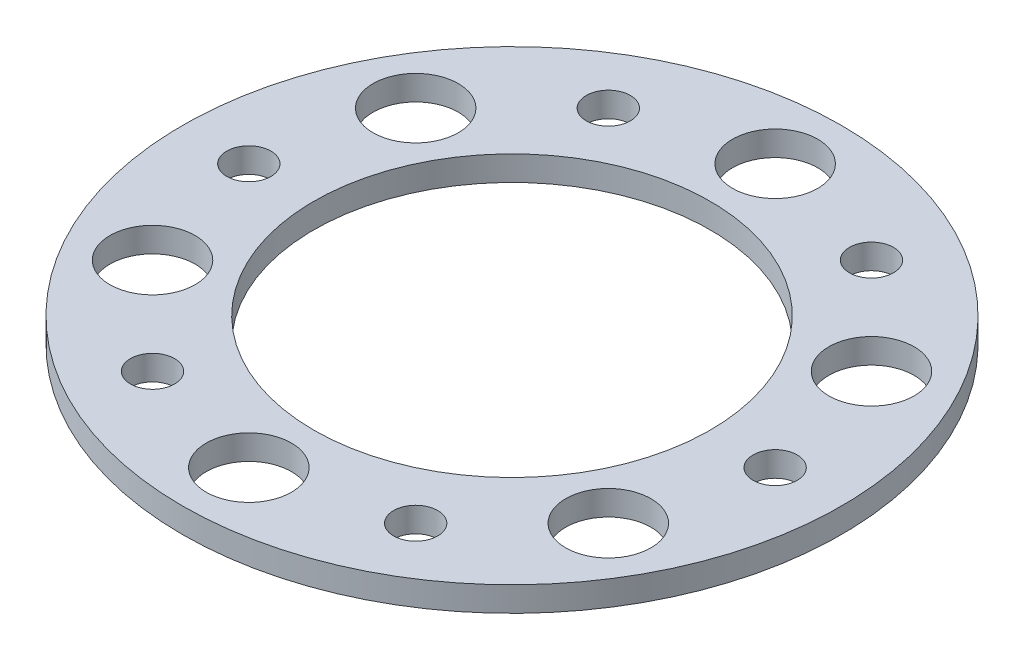
ISO-10303-21;
HEADER;
FILE_DESCRIPTION(('STEP AP214'),'2;1');
FILE_NAME('part.step','',(''),(''),'','','');
FILE_SCHEMA(('AUTOMOTIVE_DESIGN { 1 0 10303 214 1 1 1 1 }'));
ENDSEC;
DATA;
#1=APPLICATION_CONTEXT('core data for automotive mechanical design processes');
#2=APPLICATION_PROTOCOL_DEFINITION('international standard','automotive_design',2000,#1);
#3=PRODUCT_CONTEXT('',#1,'mechanical');
#4=PRODUCT('Part','Part','',(#3));
#5=PRODUCT_RELATED_PRODUCT_CATEGORY('part','',(#4));
#6=PRODUCT_DEFINITION_FORMATION('','',#4);
#7=PRODUCT_DEFINITION_CONTEXT('part definition',#1,'design');
#8=PRODUCT_DEFINITION('design','',#6,#7);
#9=PRODUCT_DEFINITION_SHAPE('','',#8);
#10=(LENGTH_UNIT() NAMED_UNIT(*) SI_UNIT(.MILLI.,.METRE.));
#11=(NAMED_UNIT(*) PLANE_ANGLE_UNIT() SI_UNIT($,.RADIAN.));
#12=(NAMED_UNIT(*) SI_UNIT($,.STERADIAN.) SOLID_ANGLE_UNIT());
#13=UNCERTAINTY_MEASURE_WITH_UNIT(LENGTH_MEASURE(1.E-05),#10,'distance_accuracy_value','');
#14=(GEOMETRIC_REPRESENTATION_CONTEXT(3) GLOBAL_UNCERTAINTY_ASSIGNED_CONTEXT((#13)) GLOBAL_UNIT_ASSIGNED_CONTEXT((#10,
#11,#12)) REPRESENTATION_CONTEXT('',''));
#15=CARTESIAN_POINT('',(0.,0.,0.));
#16=DIRECTION('',(0.,0.,1.));
#17=DIRECTION('',(1.,0.,0.));
#18=AXIS2_PLACEMENT_3D('',#15,#16,#17);
#19=CARTESIAN_POINT('',(0.,1.27,0.));
#20=DIRECTION('',(0.,1.,0.));
#21=DIRECTION('',(0.,0.,1.));
#22=AXIS2_PLACEMENT_3D('',#19,#20,#21);
#23=PLANE('',#22);
#24=CARTESIAN_POINT('',(-6.74370000000002,1.27,-11.6804310310022));
#25=DIRECTION('',(0.,1.,0.));
#26=DIRECTION('',(0.,0.,1.));
#27=AXIS2_PLACEMENT_3D('',#24,#25,#26);
#28=CIRCLE('',#27,1.1303);
#29=CARTESIAN_POINT('',(-6.74370000000002,1.27,-10.5501310310022));
#30=VERTEX_POINT('',#29);
#31=EDGE_CURVE('E119',#30,#30,#28,.T.);
#32=ORIENTED_EDGE('',*,*,#31,.F.);
#33=EDGE_LOOP('',(#32));
#34=FACE_BOUND('',#33,.T.);
#35=CARTESIAN_POINT('',(6.74369999999998,1.27,-11.6804310310028));
#36=DIRECTION('',(0.,1.,0.));
#37=DIRECTION('',(0.,0.,1.));
#38=AXIS2_PLACEMENT_3D('',#35,#36,#37);
#39=CIRCLE('',#38,1.1303);
#40=CARTESIAN_POINT('',(6.74369999999998,1.27,-10.5501310310028));
#41=VERTEX_POINT('',#40);
#42=EDGE_CURVE('E113',#41,#41,#39,.T.);
#43=ORIENTED_EDGE('',*,*,#42,.F.);
#44=EDGE_LOOP('',(#43));
#45=FACE_BOUND('',#44,.T.);
#46=CARTESIAN_POINT('',(13.4874000000005,1.27,-8.26001260817148E-13));
#47=DIRECTION('',(0.,1.,0.));
#48=DIRECTION('',(0.,0.,1.));
#49=AXIS2_PLACEMENT_3D('',#46,#47,#48);
#50=CIRCLE('',#49,1.1303);
#51=CARTESIAN_POINT('',(13.4874000000005,1.27,1.13029999999917));
#52=VERTEX_POINT('',#51);
#53=EDGE_CURVE('E107',#52,#52,#50,.T.);
#54=ORIENTED_EDGE('',*,*,#53,.F.);
#55=EDGE_LOOP('',(#54));
#56=FACE_BOUND('',#55,.T.);
#57=CARTESIAN_POINT('',(6.74370000000095,1.27,11.6804310310017));
#58=DIRECTION('',(0.,1.,0.));
#59=DIRECTION('',(0.,0.,1.));
#60=AXIS2_PLACEMENT_3D('',#57,#58,#59);
#61=CIRCLE('',#60,1.1303);
#62=CARTESIAN_POINT('',(6.74370000000095,1.27,12.8107310310017));
#63=VERTEX_POINT('',#62);
#64=EDGE_CURVE('E101',#63,#63,#61,.T.);
#65=ORIENTED_EDGE('',*,*,#64,.F.);
#66=EDGE_LOOP('',(#65));
#67=FACE_BOUND('',#66,.T.);
#68=CARTESIAN_POINT('',(-6.74369999999905,1.27,11.6804310310023));
#69=DIRECTION('',(0.,1.,0.));
#70=DIRECTION('',(0.,0.,1.));
#71=AXIS2_PLACEMENT_3D('',#68,#69,#70);
#72=CIRCLE('',#71,1.1303);
#73=CARTESIAN_POINT('',(-6.74369999999905,1.27,12.8107310310023));
#74=VERTEX_POINT('',#73);
#75=EDGE_CURVE('E95',#74,#74,#72,.T.);
#76=ORIENTED_EDGE('',*,*,#75,.F.);
#77=EDGE_LOOP('',(#76));
#78=FACE_BOUND('',#77,.T.);
#79=CARTESIAN_POINT('',(-13.4873999999995,1.27,2.87911722612592E-13));
#80=DIRECTION('',(0.,1.,0.));
#81=DIRECTION('',(0.,0.,1.));
#82=AXIS2_PLACEMENT_3D('',#79,#80,#81);
#83=CIRCLE('',#82,1.1303);
#84=CARTESIAN_POINT('',(-13.4873999999995,1.27,1.13030000000029));
#85=VERTEX_POINT('',#84);
#86=EDGE_CURVE('E89',#85,#85,#83,.T.);
#87=ORIENTED_EDGE('',*,*,#86,.F.);
#88=EDGE_LOOP('',(#87));
#89=FACE_BOUND('',#88,.T.);
#90=CARTESIAN_POINT('',(11.6804310310025,1.27,-6.74370000000049));
#91=DIRECTION('',(0.,1.,0.));
#92=DIRECTION('',(0.,0.,1.));
#93=AXIS2_PLACEMENT_3D('',#90,#91,#92);
#94=CIRCLE('',#93,2.18439999999997);
#95=CARTESIAN_POINT('',(11.6804310310025,1.27,-4.55930000000052));
#96=VERTEX_POINT('',#95);
#97=EDGE_CURVE('E81',#96,#96,#94,.T.);
#98=ORIENTED_EDGE('',*,*,#97,.F.);
#99=EDGE_LOOP('',(#98));
#100=FACE_BOUND('',#99,.T.);
#101=CARTESIAN_POINT('',(11.6804310310031,1.27,6.74369999999951));
#102=DIRECTION('',(0.,1.,0.));
#103=DIRECTION('',(0.,0.,1.));
#104=AXIS2_PLACEMENT_3D('',#101,#102,#103);
#105=CIRCLE('',#104,2.18440000000055);
#106=CARTESIAN_POINT('',(11.6804310310031,1.27,8.92810000000006));
#107=VERTEX_POINT('',#106);
#108=EDGE_CURVE('E75',#107,#107,#105,.T.);
#109=ORIENTED_EDGE('',*,*,#108,.F.);
#110=EDGE_LOOP('',(#109));
#111=FACE_BOUND('',#110,.T.);
#112=CARTESIAN_POINT('',(1.14339797081937E-12,1.27,13.4874));
#113=DIRECTION('',(0.,1.,0.));
#114=DIRECTION('',(0.,0.,1.));
#115=AXIS2_PLACEMENT_3D('',#112,#113,#114);
#116=CIRCLE('',#115,2.184400000001);
#117=CARTESIAN_POINT('',(1.14339797081937E-12,1.27,15.671800000001));
#118=VERTEX_POINT('',#117);
#119=EDGE_CURVE('E69',#118,#118,#116,.T.);
#120=ORIENTED_EDGE('',*,*,#119,.F.);
#121=EDGE_LOOP('',(#120));
#122=FACE_BOUND('',#121,.T.);
#123=CARTESIAN_POINT('',(-11.6804310310014,1.27,6.74370000000049));
#124=DIRECTION('',(0.,1.,0.));
#125=DIRECTION('',(0.,0.,1.));
#126=AXIS2_PLACEMENT_3D('',#123,#124,#125);
#127=CIRCLE('',#126,2.1844000000009);
#128=CARTESIAN_POINT('',(-11.6804310310014,1.27,8.9281000000014));
#129=VERTEX_POINT('',#128);
#130=EDGE_CURVE('E63',#129,#129,#127,.T.);
#131=ORIENTED_EDGE('',*,*,#130,.F.);
#132=EDGE_LOOP('',(#131));
#133=FACE_BOUND('',#132,.T.);
#134=CARTESIAN_POINT('',(-11.680431031002,1.27,-6.74369999999951));
#135=DIRECTION('',(0.,1.,0.));
#136=DIRECTION('',(0.,0.,1.));
#137=AXIS2_PLACEMENT_3D('',#134,#135,#136);
#138=CIRCLE('',#137,2.18440000000039);
#139=CARTESIAN_POINT('',(-11.680431031002,1.27,-4.55929999999912));
#140=VERTEX_POINT('',#139);
#141=EDGE_CURVE('E57',#140,#140,#138,.T.);
#142=ORIENTED_EDGE('',*,*,#141,.F.);
#143=EDGE_LOOP('',(#142));
#144=FACE_BOUND('',#143,.T.);
#145=CARTESIAN_POINT('',(0.,1.27,-13.4874));
#146=DIRECTION('',(0.,1.,0.));
#147=DIRECTION('',(0.,0.,1.));
#148=AXIS2_PLACEMENT_3D('',#145,#146,#147);
#149=CIRCLE('',#148,2.1844);
#150=CARTESIAN_POINT('',(0.,1.27,-11.303));
#151=VERTEX_POINT('',#150);
#152=EDGE_CURVE('E51',#151,#151,#149,.T.);
#153=ORIENTED_EDGE('',*,*,#152,.F.);
#154=EDGE_LOOP('',(#153));
#155=FACE_BOUND('',#154,.T.);
#156=CARTESIAN_POINT('',(0.,1.27,0.));
#157=DIRECTION('',(0.,1.,0.));
#158=DIRECTION('',(0.,0.,1.));
#159=AXIS2_PLACEMENT_3D('',#156,#157,#158);
#160=CIRCLE('',#159,16.891);
#161=CARTESIAN_POINT('',(0.,1.27,16.891));
#162=VERTEX_POINT('',#161);
#163=EDGE_CURVE('E10',#162,#162,#160,.T.);
#164=ORIENTED_EDGE('',*,*,#163,.T.);
#165=EDGE_LOOP('',(#164));
#166=FACE_BOUND('',#165,.T.);
#167=CARTESIAN_POINT('',(0.,1.27,0.));
#168=DIRECTION('',(0.,1.,0.));
#169=DIRECTION('',(0.,0.,1.));
#170=AXIS2_PLACEMENT_3D('',#167,#168,#169);
#171=CIRCLE('',#170,10.16);
#172=CARTESIAN_POINT('',(0.,1.27,10.16));
#173=VERTEX_POINT('',#172);
#174=EDGE_CURVE('E43',#173,#173,#171,.T.);
#175=ORIENTED_EDGE('',*,*,#174,.F.);
#176=EDGE_LOOP('',(#175));
#177=FACE_BOUND('',#176,.T.);
#178=ADVANCED_FACE('F32',(#34,#45,#56,#67,#78,#89,#100,#111,#122,#133,#144,#155,#166,#177),#23,.T.);
#179=CARTESIAN_POINT('',(0.,0.,0.));
#180=DIRECTION('',(0.,1.,0.));
#181=DIRECTION('',(0.,0.,1.));
#182=AXIS2_PLACEMENT_3D('',#179,#180,#181);
#183=PLANE('',#182);
#184=CARTESIAN_POINT('',(-6.74370000000002,0.,-11.6804310310022));
#185=DIRECTION('',(0.,1.,0.));
#186=DIRECTION('',(0.,0.,1.));
#187=AXIS2_PLACEMENT_3D('',#184,#185,#186);
#188=CIRCLE('',#187,1.1303);
#189=CARTESIAN_POINT('',(-6.74370000000002,0.,-10.5501310310022));
#190=VERTEX_POINT('',#189);
#191=EDGE_CURVE('E116',#190,#190,#188,.T.);
#192=ORIENTED_EDGE('',*,*,#191,.T.);
#193=EDGE_LOOP('',(#192));
#194=FACE_BOUND('',#193,.T.);
#195=CARTESIAN_POINT('',(6.74369999999998,0.,-11.6804310310028));
#196=DIRECTION('',(0.,1.,0.));
#197=DIRECTION('',(0.,0.,1.));
#198=AXIS2_PLACEMENT_3D('',#195,#196,#197);
#199=CIRCLE('',#198,1.1303);
#200=CARTESIAN_POINT('',(6.74369999999998,0.,-10.5501310310028));
#201=VERTEX_POINT('',#200);
#202=EDGE_CURVE('E110',#201,#201,#199,.T.);
#203=ORIENTED_EDGE('',*,*,#202,.T.);
#204=EDGE_LOOP('',(#203));
#205=FACE_BOUND('',#204,.T.);
#206=CARTESIAN_POINT('',(13.4874000000005,0.,-8.26001260817148E-13));
#207=DIRECTION('',(0.,1.,0.));
#208=DIRECTION('',(0.,0.,1.));
#209=AXIS2_PLACEMENT_3D('',#206,#207,#208);
#210=CIRCLE('',#209,1.1303);
#211=CARTESIAN_POINT('',(13.4874000000005,0.,1.13029999999917));
#212=VERTEX_POINT('',#211);
#213=EDGE_CURVE('E104',#212,#212,#210,.T.);
#214=ORIENTED_EDGE('',*,*,#213,.T.);
#215=EDGE_LOOP('',(#214));
#216=FACE_BOUND('',#215,.T.);
#217=CARTESIAN_POINT('',(6.74370000000095,0.,11.6804310310017));
#218=DIRECTION('',(0.,1.,0.));
#219=DIRECTION('',(0.,0.,1.));
#220=AXIS2_PLACEMENT_3D('',#217,#218,#219);
#221=CIRCLE('',#220,1.1303);
#222=CARTESIAN_POINT('',(6.74370000000095,0.,12.8107310310017));
#223=VERTEX_POINT('',#222);
#224=EDGE_CURVE('E98',#223,#223,#221,.T.);
#225=ORIENTED_EDGE('',*,*,#224,.T.);
#226=EDGE_LOOP('',(#225));
#227=FACE_BOUND('',#226,.T.);
#228=CARTESIAN_POINT('',(-6.74369999999905,0.,11.6804310310023));
#229=DIRECTION('',(0.,1.,0.));
#230=DIRECTION('',(0.,0.,1.));
#231=AXIS2_PLACEMENT_3D('',#228,#229,#230);
#232=CIRCLE('',#231,1.1303);
#233=CARTESIAN_POINT('',(-6.74369999999905,0.,12.8107310310023));
#234=VERTEX_POINT('',#233);
#235=EDGE_CURVE('E92',#234,#234,#232,.T.);
#236=ORIENTED_EDGE('',*,*,#235,.T.);
#237=EDGE_LOOP('',(#236));
#238=FACE_BOUND('',#237,.T.);
#239=CARTESIAN_POINT('',(-13.4873999999995,0.,2.87911722612592E-13));
#240=DIRECTION('',(0.,1.,0.));
#241=DIRECTION('',(0.,0.,1.));
#242=AXIS2_PLACEMENT_3D('',#239,#240,#241);
#243=CIRCLE('',#242,1.1303);
#244=CARTESIAN_POINT('',(-13.4873999999995,0.,1.13030000000029));
#245=VERTEX_POINT('',#244);
#246=EDGE_CURVE('E84',#245,#245,#243,.T.);
#247=ORIENTED_EDGE('',*,*,#246,.T.);
#248=EDGE_LOOP('',(#247));
#249=FACE_BOUND('',#248,.T.);
#250=CARTESIAN_POINT('',(11.6804310310025,0.,-6.74370000000049));
#251=DIRECTION('',(0.,1.,0.));
#252=DIRECTION('',(0.,0.,1.));
#253=AXIS2_PLACEMENT_3D('',#250,#251,#252);
#254=CIRCLE('',#253,2.18439999999997);
#255=CARTESIAN_POINT('',(11.6804310310025,0.,-4.55930000000052));
#256=VERTEX_POINT('',#255);
#257=EDGE_CURVE('E78',#256,#256,#254,.T.);
#258=ORIENTED_EDGE('',*,*,#257,.T.);
#259=EDGE_LOOP('',(#258));
#260=FACE_BOUND('',#259,.T.);
#261=CARTESIAN_POINT('',(11.6804310310031,0.,6.74369999999951));
#262=DIRECTION('',(0.,1.,0.));
#263=DIRECTION('',(0.,0.,1.));
#264=AXIS2_PLACEMENT_3D('',#261,#262,#263);
#265=CIRCLE('',#264,2.18440000000055);
#266=CARTESIAN_POINT('',(11.6804310310031,0.,8.92810000000006));
#267=VERTEX_POINT('',#266);
#268=EDGE_CURVE('E72',#267,#267,#265,.T.);
#269=ORIENTED_EDGE('',*,*,#268,.T.);
#270=EDGE_LOOP('',(#269));
#271=FACE_BOUND('',#270,.T.);
#272=CARTESIAN_POINT('',(1.14339797081937E-12,0.,13.4874));
#273=DIRECTION('',(0.,1.,0.));
#274=DIRECTION('',(0.,0.,1.));
#275=AXIS2_PLACEMENT_3D('',#272,#273,#274);
#276=CIRCLE('',#275,2.184400000001);
#277=CARTESIAN_POINT('',(1.14339797081937E-12,0.,15.671800000001));
#278=VERTEX_POINT('',#277);
#279=EDGE_CURVE('E66',#278,#278,#276,.T.);
#280=ORIENTED_EDGE('',*,*,#279,.T.);
#281=EDGE_LOOP('',(#280));
#282=FACE_BOUND('',#281,.T.);
#283=CARTESIAN_POINT('',(-11.6804310310014,0.,6.74370000000049));
#284=DIRECTION('',(0.,1.,0.));
#285=DIRECTION('',(0.,0.,1.));
#286=AXIS2_PLACEMENT_3D('',#283,#284,#285);
#287=CIRCLE('',#286,2.1844000000009);
#288=CARTESIAN_POINT('',(-11.6804310310014,0.,8.9281000000014));
#289=VERTEX_POINT('',#288);
#290=EDGE_CURVE('E60',#289,#289,#287,.T.);
#291=ORIENTED_EDGE('',*,*,#290,.T.);
#292=EDGE_LOOP('',(#291));
#293=FACE_BOUND('',#292,.T.);
#294=CARTESIAN_POINT('',(-11.680431031002,0.,-6.74369999999951));
#295=DIRECTION('',(0.,1.,0.));
#296=DIRECTION('',(0.,0.,1.));
#297=AXIS2_PLACEMENT_3D('',#294,#295,#296);
#298=CIRCLE('',#297,2.18440000000039);
#299=CARTESIAN_POINT('',(-11.680431031002,0.,-4.55929999999912));
#300=VERTEX_POINT('',#299);
#301=EDGE_CURVE('E54',#300,#300,#298,.T.);
#302=ORIENTED_EDGE('',*,*,#301,.T.);
#303=EDGE_LOOP('',(#302));
#304=FACE_BOUND('',#303,.T.);
#305=CARTESIAN_POINT('',(0.,0.,-13.4874));
#306=DIRECTION('',(0.,1.,0.));
#307=DIRECTION('',(0.,0.,1.));
#308=AXIS2_PLACEMENT_3D('',#305,#306,#307);
#309=CIRCLE('',#308,2.1844);
#310=CARTESIAN_POINT('',(0.,0.,-11.303));
#311=VERTEX_POINT('',#310);
#312=EDGE_CURVE('E48',#311,#311,#309,.T.);
#313=ORIENTED_EDGE('',*,*,#312,.T.);
#314=EDGE_LOOP('',(#313));
#315=FACE_BOUND('',#314,.T.);
#316=CARTESIAN_POINT('',(0.,0.,0.));
#317=DIRECTION('',(0.,1.,0.));
#318=DIRECTION('',(0.,0.,1.));
#319=AXIS2_PLACEMENT_3D('',#316,#317,#318);
#320=CIRCLE('',#319,16.891);
#321=CARTESIAN_POINT('',(0.,0.,16.891));
#322=VERTEX_POINT('',#321);
#323=EDGE_CURVE('E36',#322,#322,#320,.T.);
#324=ORIENTED_EDGE('',*,*,#323,.F.);
#325=EDGE_LOOP('',(#324));
#326=FACE_BOUND('',#325,.T.);
#327=CARTESIAN_POINT('',(0.,0.,0.));
#328=DIRECTION('',(0.,1.,0.));
#329=DIRECTION('',(0.,0.,1.));
#330=AXIS2_PLACEMENT_3D('',#327,#328,#329);
#331=CIRCLE('',#330,10.16);
#332=CARTESIAN_POINT('',(0.,0.,10.16));
#333=VERTEX_POINT('',#332);
#334=EDGE_CURVE('E45',#333,#333,#331,.T.);
#335=ORIENTED_EDGE('',*,*,#334,.T.);
#336=EDGE_LOOP('',(#335));
#337=FACE_BOUND('',#336,.T.);
#338=ADVANCED_FACE('F127',(#194,#205,#216,#227,#238,#249,#260,#271,#282,#293,#304,#315,#326,
#337),#183,.F.);
#339=CARTESIAN_POINT('',(0.,1.27,0.));
#340=DIRECTION('',(0.,-1.,0.));
#341=DIRECTION('',(0.,0.,-1.));
#342=AXIS2_PLACEMENT_3D('',#339,#340,#341);
#343=CYLINDRICAL_SURFACE('',#342,16.891);
#344=ORIENTED_EDGE('',*,*,#163,.F.);
#345=EDGE_LOOP('',(#344));
#346=FACE_BOUND('',#345,.T.);
#347=ORIENTED_EDGE('',*,*,#323,.T.);
#348=EDGE_LOOP('',(#347));
#349=FACE_BOUND('',#348,.T.);
#350=ADVANCED_FACE('F34',(#346,#349),#343,.T.);
#351=CARTESIAN_POINT('',(0.,1.27,0.));
#352=DIRECTION('',(0.,-1.,0.));
#353=DIRECTION('',(0.,0.,-1.));
#354=AXIS2_PLACEMENT_3D('',#351,#352,#353);
#355=CYLINDRICAL_SURFACE('',#354,10.16);
#356=ORIENTED_EDGE('',*,*,#174,.T.);
#357=EDGE_LOOP('',(#356));
#358=FACE_BOUND('',#357,.T.);
#359=ORIENTED_EDGE('',*,*,#334,.F.);
#360=EDGE_LOOP('',(#359));
#361=FACE_BOUND('',#360,.T.);
#362=ADVANCED_FACE('F153',(#358,#361),#355,.F.);
#363=CARTESIAN_POINT('',(0.,0.,-13.4874));
#364=DIRECTION('',(0.,1.,0.));
#365=DIRECTION('',(0.,0.,1.));
#366=AXIS2_PLACEMENT_3D('',#363,#364,#365);
#367=CYLINDRICAL_SURFACE('',#366,2.1844);
#368=ORIENTED_EDGE('',*,*,#312,.F.);
#369=EDGE_LOOP('',(#368));
#370=FACE_BOUND('',#369,.T.);
#371=ORIENTED_EDGE('',*,*,#152,.T.);
#372=EDGE_LOOP('',(#371));
#373=FACE_BOUND('',#372,.T.);
#374=ADVANCED_FACE('F156',(#370,#373),#367,.F.);
#375=CARTESIAN_POINT('',(-11.680431031002,0.,-6.74369999999951));
#376=DIRECTION('',(0.,1.,0.));
#377=DIRECTION('',(0.,0.,1.));
#378=AXIS2_PLACEMENT_3D('',#375,#376,#377);
#379=CYLINDRICAL_SURFACE('',#378,2.18440000000039);
#380=ORIENTED_EDGE('',*,*,#301,.F.);
#381=EDGE_LOOP('',(#380));
#382=FACE_BOUND('',#381,.T.);
#383=ORIENTED_EDGE('',*,*,#141,.T.);
#384=EDGE_LOOP('',(#383));
#385=FACE_BOUND('',#384,.T.);
#386=ADVANCED_FACE('F170',(#382,#385),#379,.F.);
#387=CARTESIAN_POINT('',(-11.6804310310014,0.,6.74370000000049));
#388=DIRECTION('',(0.,1.,0.));
#389=DIRECTION('',(0.,0.,1.));
#390=AXIS2_PLACEMENT_3D('',#387,#388,#389);
#391=CYLINDRICAL_SURFACE('',#390,2.1844000000009);
#392=ORIENTED_EDGE('',*,*,#290,.F.);
#393=EDGE_LOOP('',(#392));
#394=FACE_BOUND('',#393,.T.);
#395=ORIENTED_EDGE('',*,*,#130,.T.);
#396=EDGE_LOOP('',(#395));
#397=FACE_BOUND('',#396,.T.);
#398=ADVANCED_FACE('F174',(#394,#397),#391,.F.);
#399=CARTESIAN_POINT('',(1.14339797081937E-12,0.,13.4874));
#400=DIRECTION('',(0.,1.,0.));
#401=DIRECTION('',(0.,0.,1.));
#402=AXIS2_PLACEMENT_3D('',#399,#400,#401);
#403=CYLINDRICAL_SURFACE('',#402,2.184400000001);
#404=ORIENTED_EDGE('',*,*,#279,.F.);
#405=EDGE_LOOP('',(#404));
#406=FACE_BOUND('',#405,.T.);
#407=ORIENTED_EDGE('',*,*,#119,.T.);
#408=EDGE_LOOP('',(#407));
#409=FACE_BOUND('',#408,.T.);
#410=ADVANCED_FACE('F178',(#406,#409),#403,.F.);
#411=CARTESIAN_POINT('',(11.6804310310031,0.,6.74369999999951));
#412=DIRECTION('',(0.,1.,0.));
#413=DIRECTION('',(0.,0.,1.));
#414=AXIS2_PLACEMENT_3D('',#411,#412,#413);
#415=CYLINDRICAL_SURFACE('',#414,2.18440000000055);
#416=ORIENTED_EDGE('',*,*,#268,.F.);
#417=EDGE_LOOP('',(#416));
#418=FACE_BOUND('',#417,.T.);
#419=ORIENTED_EDGE('',*,*,#108,.T.);
#420=EDGE_LOOP('',(#419));
#421=FACE_BOUND('',#420,.T.);
#422=ADVANCED_FACE('F182',(#418,#421),#415,.F.);
#423=CARTESIAN_POINT('',(11.6804310310025,0.,-6.74370000000049));
#424=DIRECTION('',(0.,1.,0.));
#425=DIRECTION('',(0.,0.,1.));
#426=AXIS2_PLACEMENT_3D('',#423,#424,#425);
#427=CYLINDRICAL_SURFACE('',#426,2.18439999999997);
#428=ORIENTED_EDGE('',*,*,#257,.F.);
#429=EDGE_LOOP('',(#428));
#430=FACE_BOUND('',#429,.T.);
#431=ORIENTED_EDGE('',*,*,#97,.T.);
#432=EDGE_LOOP('',(#431));
#433=FACE_BOUND('',#432,.T.);
#434=ADVANCED_FACE('F186',(#430,#433),#427,.F.);
#435=CARTESIAN_POINT('',(-13.4873999999995,1.27,2.87911722612592E-13));
#436=DIRECTION('',(0.,1.,0.));
#437=DIRECTION('',(0.,0.,1.));
#438=AXIS2_PLACEMENT_3D('',#435,#436,#437);
#439=CYLINDRICAL_SURFACE('',#438,1.1303);
#440=ORIENTED_EDGE('',*,*,#246,.F.);
#441=EDGE_LOOP('',(#440));
#442=FACE_BOUND('',#441,.T.);
#443=ORIENTED_EDGE('',*,*,#86,.T.);
#444=EDGE_LOOP('',(#443));
#445=FACE_BOUND('',#444,.T.);
#446=ADVANCED_FACE('F190',(#442,#445),#439,.F.);
#447=CARTESIAN_POINT('',(-6.74369999999905,1.27,11.6804310310023));
#448=DIRECTION('',(0.,1.,0.));
#449=DIRECTION('',(0.,0.,1.));
#450=AXIS2_PLACEMENT_3D('',#447,#448,#449);
#451=CYLINDRICAL_SURFACE('',#450,1.1303);
#452=ORIENTED_EDGE('',*,*,#235,.F.);
#453=EDGE_LOOP('',(#452));
#454=FACE_BOUND('',#453,.T.);
#455=ORIENTED_EDGE('',*,*,#75,.T.);
#456=EDGE_LOOP('',(#455));
#457=FACE_BOUND('',#456,.T.);
#458=ADVANCED_FACE('F194',(#454,#457),#451,.F.);
#459=CARTESIAN_POINT('',(6.74370000000095,1.27,11.6804310310017));
#460=DIRECTION('',(0.,1.,0.));
#461=DIRECTION('',(0.,0.,1.));
#462=AXIS2_PLACEMENT_3D('',#459,#460,#461);
#463=CYLINDRICAL_SURFACE('',#462,1.1303);
#464=ORIENTED_EDGE('',*,*,#224,.F.);
#465=EDGE_LOOP('',(#464));
#466=FACE_BOUND('',#465,.T.);
#467=ORIENTED_EDGE('',*,*,#64,.T.);
#468=EDGE_LOOP('',(#467));
#469=FACE_BOUND('',#468,.T.);
#470=ADVANCED_FACE('F198',(#466,#469),#463,.F.);
#471=CARTESIAN_POINT('',(13.4874000000005,1.27,-8.26001260817148E-13));
#472=DIRECTION('',(0.,1.,0.));
#473=DIRECTION('',(0.,0.,1.));
#474=AXIS2_PLACEMENT_3D('',#471,#472,#473);
#475=CYLINDRICAL_SURFACE('',#474,1.1303);
#476=ORIENTED_EDGE('',*,*,#213,.F.);
#477=EDGE_LOOP('',(#476));
#478=FACE_BOUND('',#477,.T.);
#479=ORIENTED_EDGE('',*,*,#53,.T.);
#480=EDGE_LOOP('',(#479));
#481=FACE_BOUND('',#480,.T.);
#482=ADVANCED_FACE('F202',(#478,#481),#475,.F.);
#483=CARTESIAN_POINT('',(6.74369999999998,1.27,-11.6804310310028));
#484=DIRECTION('',(0.,1.,0.));
#485=DIRECTION('',(0.,0.,1.));
#486=AXIS2_PLACEMENT_3D('',#483,#484,#485);
#487=CYLINDRICAL_SURFACE('',#486,1.1303);
#488=ORIENTED_EDGE('',*,*,#202,.F.);
#489=EDGE_LOOP('',(#488));
#490=FACE_BOUND('',#489,.T.);
#491=ORIENTED_EDGE('',*,*,#42,.T.);
#492=EDGE_LOOP('',(#491));
#493=FACE_BOUND('',#492,.T.);
#494=ADVANCED_FACE('F206',(#490,#493),#487,.F.);
#495=CARTESIAN_POINT('',(-6.74370000000002,1.27,-11.6804310310022));
#496=DIRECTION('',(0.,1.,0.));
#497=DIRECTION('',(0.,0.,1.));
#498=AXIS2_PLACEMENT_3D('',#495,#496,#497);
#499=CYLINDRICAL_SURFACE('',#498,1.1303);
#500=ORIENTED_EDGE('',*,*,#191,.F.);
#501=EDGE_LOOP('',(#500));
#502=FACE_BOUND('',#501,.T.);
#503=ORIENTED_EDGE('',*,*,#31,.T.);
#504=EDGE_LOOP('',(#503));
#505=FACE_BOUND('',#504,.T.);
#506=ADVANCED_FACE('F123',(#502,#505),#499,.F.);
#507=CLOSED_SHELL('',(#178,#338,#350,#362,#374,#386,#398,#410,#422,#434,#446,#458,#470,#482,
#494,#506));
#508=MANIFOLD_SOLID_BREP('B2',#507);
#509=ADVANCED_BREP_SHAPE_REPRESENTATION('',(#18,#508),#14);
#510=SHAPE_DEFINITION_REPRESENTATION(#9,#509);
ENDSEC;
END-ISO-10303-21;
